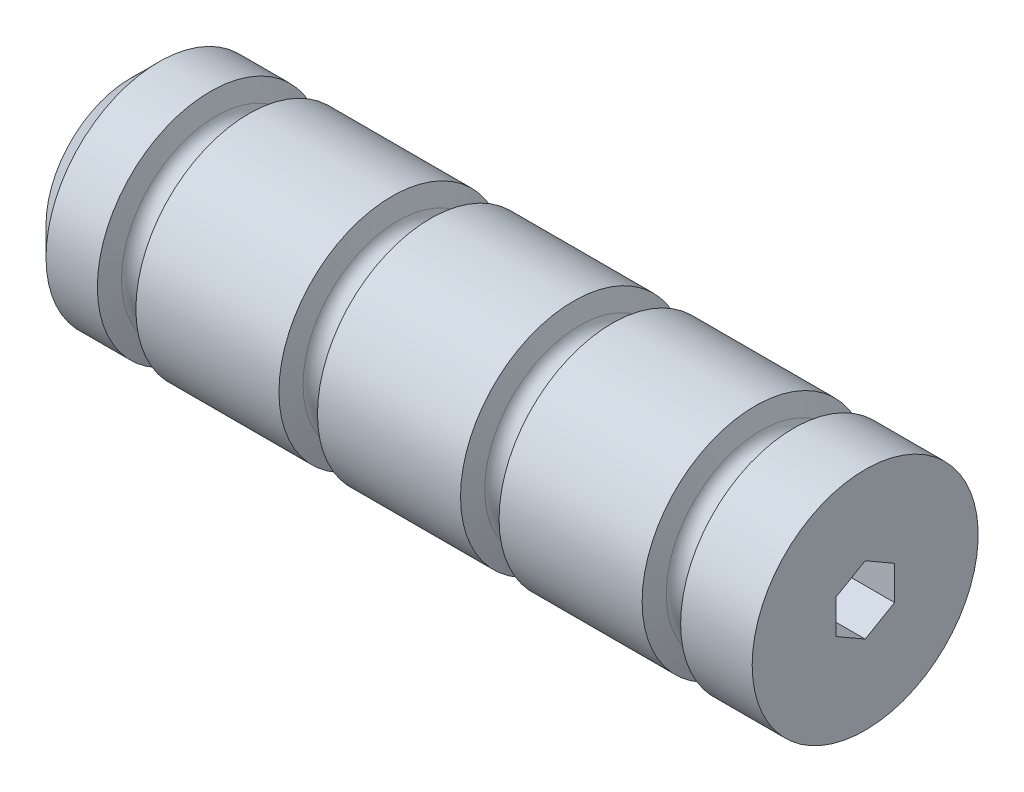
ISO-10303-21;
HEADER;
FILE_DESCRIPTION(('STEP AP214'),'2;1');
FILE_NAME('part.step','',(''),(''),'','','');
FILE_SCHEMA(('AUTOMOTIVE_DESIGN { 1 0 10303 214 1 1 1 1 }'));
ENDSEC;
DATA;
#1=APPLICATION_CONTEXT('core data for automotive mechanical design processes');
#2=APPLICATION_PROTOCOL_DEFINITION('international standard','automotive_design',2000,#1);
#3=PRODUCT_CONTEXT('',#1,'mechanical');
#4=PRODUCT('Part','Part','',(#3));
#5=PRODUCT_RELATED_PRODUCT_CATEGORY('part','',(#4));
#6=PRODUCT_DEFINITION_FORMATION('','',#4);
#7=PRODUCT_DEFINITION_CONTEXT('part definition',#1,'design');
#8=PRODUCT_DEFINITION('design','',#6,#7);
#9=PRODUCT_DEFINITION_SHAPE('','',#8);
#10=(LENGTH_UNIT() NAMED_UNIT(*) SI_UNIT(.MILLI.,.METRE.));
#11=(NAMED_UNIT(*) PLANE_ANGLE_UNIT() SI_UNIT($,.RADIAN.));
#12=(NAMED_UNIT(*) SI_UNIT($,.STERADIAN.) SOLID_ANGLE_UNIT());
#13=UNCERTAINTY_MEASURE_WITH_UNIT(LENGTH_MEASURE(1.E-05),#10,'distance_accuracy_value','');
#14=(GEOMETRIC_REPRESENTATION_CONTEXT(3) GLOBAL_UNCERTAINTY_ASSIGNED_CONTEXT((#13)) GLOBAL_UNIT_ASSIGNED_CONTEXT((#10,
#11,#12)) REPRESENTATION_CONTEXT('',''));
#15=CARTESIAN_POINT('',(0.,0.,0.));
#16=DIRECTION('',(0.,0.,1.));
#17=DIRECTION('',(1.,0.,0.));
#18=AXIS2_PLACEMENT_3D('',#15,#16,#17);
#19=CARTESIAN_POINT('',(0.,0.,0.));
#20=DIRECTION('',(-1.,0.,0.));
#21=DIRECTION('',(0.,0.,1.));
#22=AXIS2_PLACEMENT_3D('',#19,#20,#21);
#23=CYLINDRICAL_SURFACE('',#22,25.4);
#24=CARTESIAN_POINT('',(-158.75,0.,0.));
#25=DIRECTION('',(-1.,0.,0.));
#26=DIRECTION('',(0.,0.,1.));
#27=AXIS2_PLACEMENT_3D('',#24,#25,#26);
#28=CIRCLE('',#27,25.4);
#29=CARTESIAN_POINT('',(-158.75,0.,25.4));
#30=VERTEX_POINT('',#29);
#31=EDGE_CURVE('E41',#30,#30,#28,.T.);
#32=ORIENTED_EDGE('',*,*,#31,.F.);
#33=EDGE_LOOP('',(#32));
#34=FACE_BOUND('',#33,.T.);
#35=CARTESIAN_POINT('',(-147.205153627013,0.,0.));
#36=DIRECTION('',(-1.,0.,0.));
#37=DIRECTION('',(0.,0.,1.));
#38=AXIS2_PLACEMENT_3D('',#35,#36,#37);
#39=CIRCLE('',#38,25.3999999999991);
#40=CARTESIAN_POINT('',(-147.205153627013,0.,25.3999999999991));
#41=VERTEX_POINT('',#40);
#42=EDGE_CURVE('E131',#41,#41,#39,.T.);
#43=ORIENTED_EDGE('',*,*,#42,.T.);
#44=EDGE_LOOP('',(#43));
#45=FACE_BOUND('',#44,.T.);
#46=ADVANCED_FACE('F33',(#34,#45),#23,.T.);
#47=CARTESIAN_POINT('',(-158.75,0.,0.));
#48=DIRECTION('',(1.,0.,0.));
#49=DIRECTION('',(0.,0.,-1.));
#50=AXIS2_PLACEMENT_3D('',#47,#48,#49);
#51=CONICAL_SURFACE('',#50,25.4,0.785398163397449);
#52=CARTESIAN_POINT('',(-165.1,0.,0.));
#53=DIRECTION('',(-1.,0.,0.));
#54=DIRECTION('',(0.,0.,1.));
#55=AXIS2_PLACEMENT_3D('',#52,#53,#54);
#56=CIRCLE('',#55,19.05);
#57=CARTESIAN_POINT('',(-165.1,0.,19.05));
#58=VERTEX_POINT('',#57);
#59=EDGE_CURVE('E152',#58,#58,#56,.T.);
#60=ORIENTED_EDGE('',*,*,#59,.F.);
#61=EDGE_LOOP('',(#60));
#62=FACE_BOUND('',#61,.T.);
#63=ORIENTED_EDGE('',*,*,#31,.T.);
#64=EDGE_LOOP('',(#63));
#65=FACE_BOUND('',#64,.T.);
#66=ADVANCED_FACE('F191',(#62,#65),#51,.T.);
#67=CARTESIAN_POINT('',(-165.1,19.05,0.));
#68=DIRECTION('',(1.,0.,0.));
#69=DIRECTION('',(0.,0.,-1.));
#70=AXIS2_PLACEMENT_3D('',#67,#68,#69);
#71=PLANE('',#70);
#72=DIRECTION('',(0.,1.,0.));
#73=VECTOR('',#72,1.);
#74=CARTESIAN_POINT('',(-165.1,-3.81282117772829,-6.604));
#75=LINE('',#74,#73);
#76=CARTESIAN_POINT('',(-165.1,-3.81282117772829,-6.604));
#77=VERTEX_POINT('',#76);
#78=CARTESIAN_POINT('',(-165.1,3.81282117772829,-6.604));
#79=VERTEX_POINT('',#78);
#80=EDGE_CURVE('E94',#77,#79,#75,.T.);
#81=ORIENTED_EDGE('',*,*,#80,.T.);
#82=DIRECTION('',(0.,0.5,0.866025403784439));
#83=VECTOR('',#82,1.);
#84=CARTESIAN_POINT('',(-165.1,3.81282117772829,-6.604));
#85=LINE('',#84,#83);
#86=CARTESIAN_POINT('',(-165.1,7.62564235545658,0.));
#87=VERTEX_POINT('',#86);
#88=EDGE_CURVE('E88',#79,#87,#85,.T.);
#89=ORIENTED_EDGE('',*,*,#88,.T.);
#90=DIRECTION('',(0.,-0.5,0.866025403784439));
#91=VECTOR('',#90,1.);
#92=CARTESIAN_POINT('',(-165.1,7.62564235545658,0.));
#93=LINE('',#92,#91);
#94=CARTESIAN_POINT('',(-165.1,3.81282117772829,6.604));
#95=VERTEX_POINT('',#94);
#96=EDGE_CURVE('E97',#87,#95,#93,.T.);
#97=ORIENTED_EDGE('',*,*,#96,.T.);
#98=DIRECTION('',(0.,-1.,0.));
#99=VECTOR('',#98,1.);
#100=CARTESIAN_POINT('',(-165.1,3.81282117772829,6.604));
#101=LINE('',#100,#99);
#102=CARTESIAN_POINT('',(-165.1,-3.81282117772829,6.604));
#103=VERTEX_POINT('',#102);
#104=EDGE_CURVE('E48',#95,#103,#101,.T.);
#105=ORIENTED_EDGE('',*,*,#104,.T.);
#106=DIRECTION('',(0.,-0.5,-0.866025403784438));
#107=VECTOR('',#106,1.);
#108=CARTESIAN_POINT('',(-165.1,-3.81282117772829,6.604));
#109=LINE('',#108,#107);
#110=CARTESIAN_POINT('',(-165.1,-7.62564235545658,0.));
#111=VERTEX_POINT('',#110);
#112=EDGE_CURVE('E112',#103,#111,#109,.T.);
#113=ORIENTED_EDGE('',*,*,#112,.T.);
#114=DIRECTION('',(0.,0.5,-0.866025403784439));
#115=VECTOR('',#114,1.);
#116=CARTESIAN_POINT('',(-165.1,-7.62564235545658,0.));
#117=LINE('',#116,#115);
#118=EDGE_CURVE('E115',#111,#77,#117,.T.);
#119=ORIENTED_EDGE('',*,*,#118,.T.);
#120=EDGE_LOOP('',(#81,#89,#97,#105,#113,#119));
#121=FACE_BOUND('',#120,.T.);
#122=ORIENTED_EDGE('',*,*,#59,.T.);
#123=EDGE_LOOP('',(#122));
#124=FACE_BOUND('',#123,.T.);
#125=ADVANCED_FACE('F101',(#121,#124),#71,.F.);
#126=CARTESIAN_POINT('',(-139.846948681374,0.,0.));
#127=DIRECTION('',(1.,0.,0.));
#128=DIRECTION('',(0.,0.,-1.));
#129=AXIS2_PLACEMENT_3D('',#126,#127,#128);
#130=CONICAL_SURFACE('',#129,21.2702590865731,1.26536370769589);
#131=CARTESIAN_POINT('',(-138.544846372987,0.,0.));
#132=DIRECTION('',(-1.,0.,0.));
#133=DIRECTION('',(0.,0.,1.));
#134=AXIS2_PLACEMENT_3D('',#131,#132,#133);
#135=CIRCLE('',#134,25.3999999999991);
#136=CARTESIAN_POINT('',(-138.544846372987,0.,25.3999999999991));
#137=VERTEX_POINT('',#136);
#138=EDGE_CURVE('E169',#137,#137,#135,.T.);
#139=ORIENTED_EDGE('',*,*,#138,.T.);
#140=EDGE_LOOP('',(#139));
#141=FACE_BOUND('',#140,.T.);
#142=CARTESIAN_POINT('',(-139.846948681374,0.,0.));
#143=DIRECTION('',(-1.,0.,0.));
#144=DIRECTION('',(0.,0.,1.));
#145=AXIS2_PLACEMENT_3D('',#142,#143,#144);
#146=CIRCLE('',#145,21.2702590865731);
#147=CARTESIAN_POINT('',(-139.846948681374,0.,21.2702590865731));
#148=VERTEX_POINT('',#147);
#149=EDGE_CURVE('E182',#148,#148,#146,.T.);
#150=ORIENTED_EDGE('',*,*,#149,.F.);
#151=EDGE_LOOP('',(#150));
#152=FACE_BOUND('',#151,.T.);
#153=ADVANCED_FACE('F211',(#141,#152),#130,.T.);
#154=CARTESIAN_POINT('',(-142.875,0.,0.));
#155=DIRECTION('',(-1.,0.,0.));
#156=DIRECTION('',(0.,0.,1.));
#157=AXIS2_PLACEMENT_3D('',#154,#155,#156);
#158=TOROIDAL_SURFACE('',#157,22.2249999999991,3.17499999999999);
#159=ORIENTED_EDGE('',*,*,#149,.T.);
#160=EDGE_LOOP('',(#159));
#161=FACE_BOUND('',#160,.T.);
#162=CARTESIAN_POINT('',(-145.903051318626,0.,0.));
#163=DIRECTION('',(-1.,0.,0.));
#164=DIRECTION('',(0.,0.,1.));
#165=AXIS2_PLACEMENT_3D('',#162,#163,#164);
#166=CIRCLE('',#165,21.2702590865731);
#167=CARTESIAN_POINT('',(-145.903051318626,0.,21.2702590865731));
#168=VERTEX_POINT('',#167);
#169=EDGE_CURVE('E179',#168,#168,#166,.T.);
#170=ORIENTED_EDGE('',*,*,#169,.F.);
#171=EDGE_LOOP('',(#170));
#172=FACE_BOUND('',#171,.T.);
#173=ADVANCED_FACE('F201',(#161,#172),#158,.F.);
#174=CARTESIAN_POINT('',(-147.205153627013,0.,0.));
#175=DIRECTION('',(-1.,0.,0.));
#176=DIRECTION('',(0.,0.,1.));
#177=AXIS2_PLACEMENT_3D('',#174,#175,#176);
#178=CONICAL_SURFACE('',#177,25.3999999999991,1.26536370769589);
#179=ORIENTED_EDGE('',*,*,#169,.T.);
#180=EDGE_LOOP('',(#179));
#181=FACE_BOUND('',#180,.T.);
#182=ORIENTED_EDGE('',*,*,#42,.F.);
#183=EDGE_LOOP('',(#182));
#184=FACE_BOUND('',#183,.T.);
#185=ADVANCED_FACE('F199',(#181,#184),#178,.T.);
#186=ORIENTED_EDGE('',*,*,#138,.F.);
#187=EDGE_LOOP('',(#186));
#188=FACE_BOUND('',#187,.T.);
#189=CARTESIAN_POINT('',(-106.383725055584,0.,0.));
#190=DIRECTION('',(-1.,0.,0.));
#191=DIRECTION('',(0.,0.,1.));
#192=AXIS2_PLACEMENT_3D('',#189,#190,#191);
#193=CIRCLE('',#192,25.3999999999994);
#194=CARTESIAN_POINT('',(-106.383725055584,0.,25.3999999999994));
#195=VERTEX_POINT('',#194);
#196=EDGE_CURVE('E165',#195,#195,#193,.T.);
#197=ORIENTED_EDGE('',*,*,#196,.T.);
#198=EDGE_LOOP('',(#197));
#199=FACE_BOUND('',#198,.T.);
#200=ADVANCED_FACE('F196',(#188,#199),#23,.T.);
#201=CARTESIAN_POINT('',(-99.0255201099458,0.,0.));
#202=DIRECTION('',(1.,0.,0.));
#203=DIRECTION('',(0.,0.,-1.));
#204=AXIS2_PLACEMENT_3D('',#201,#202,#203);
#205=CONICAL_SURFACE('',#204,21.2702590865734,1.26536370769589);
#206=CARTESIAN_POINT('',(-97.7234178015586,0.,0.));
#207=DIRECTION('',(-1.,0.,0.));
#208=DIRECTION('',(0.,0.,1.));
#209=AXIS2_PLACEMENT_3D('',#206,#207,#208);
#210=CIRCLE('',#209,25.3999999999994);
#211=CARTESIAN_POINT('',(-97.7234178015586,0.,25.3999999999994));
#212=VERTEX_POINT('',#211);
#213=EDGE_CURVE('E157',#212,#212,#210,.T.);
#214=ORIENTED_EDGE('',*,*,#213,.T.);
#215=EDGE_LOOP('',(#214));
#216=FACE_BOUND('',#215,.T.);
#217=CARTESIAN_POINT('',(-99.0255201099458,0.,0.));
#218=DIRECTION('',(-1.,0.,0.));
#219=DIRECTION('',(0.,0.,1.));
#220=AXIS2_PLACEMENT_3D('',#217,#218,#219);
#221=CIRCLE('',#220,21.2702590865734);
#222=CARTESIAN_POINT('',(-99.0255201099458,0.,21.2702590865734));
#223=VERTEX_POINT('',#222);
#224=EDGE_CURVE('E172',#223,#223,#221,.T.);
#225=ORIENTED_EDGE('',*,*,#224,.F.);
#226=EDGE_LOOP('',(#225));
#227=FACE_BOUND('',#226,.T.);
#228=ADVANCED_FACE('F208',(#216,#227),#205,.T.);
#229=CARTESIAN_POINT('',(-102.053571428571,0.,0.));
#230=DIRECTION('',(-1.,0.,0.));
#231=DIRECTION('',(0.,0.,1.));
#232=AXIS2_PLACEMENT_3D('',#229,#230,#231);
#233=TOROIDAL_SURFACE('',#232,22.2249999999994,3.17499999999999);
#234=ORIENTED_EDGE('',*,*,#224,.T.);
#235=EDGE_LOOP('',(#234));
#236=FACE_BOUND('',#235,.T.);
#237=CARTESIAN_POINT('',(-105.081622747197,0.,0.));
#238=DIRECTION('',(-1.,0.,0.));
#239=DIRECTION('',(0.,0.,1.));
#240=AXIS2_PLACEMENT_3D('',#237,#238,#239);
#241=CIRCLE('',#240,21.2702590865734);
#242=CARTESIAN_POINT('',(-105.081622747197,0.,21.2702590865734));
#243=VERTEX_POINT('',#242);
#244=EDGE_CURVE('E168',#243,#243,#241,.T.);
#245=ORIENTED_EDGE('',*,*,#244,.F.);
#246=EDGE_LOOP('',(#245));
#247=FACE_BOUND('',#246,.T.);
#248=ADVANCED_FACE('F262',(#236,#247),#233,.F.);
#249=CARTESIAN_POINT('',(-106.383725055584,0.,0.));
#250=DIRECTION('',(-1.,0.,0.));
#251=DIRECTION('',(0.,0.,1.));
#252=AXIS2_PLACEMENT_3D('',#249,#250,#251);
#253=CONICAL_SURFACE('',#252,25.3999999999994,1.26536370769589);
#254=ORIENTED_EDGE('',*,*,#244,.T.);
#255=EDGE_LOOP('',(#254));
#256=FACE_BOUND('',#255,.T.);
#257=ORIENTED_EDGE('',*,*,#196,.F.);
#258=EDGE_LOOP('',(#257));
#259=FACE_BOUND('',#258,.T.);
#260=ADVANCED_FACE('F254',(#256,#259),#253,.T.);
#261=ORIENTED_EDGE('',*,*,#213,.F.);
#262=EDGE_LOOP('',(#261));
#263=FACE_BOUND('',#262,.T.);
#264=CARTESIAN_POINT('',(-65.5622964841557,0.,0.));
#265=DIRECTION('',(-1.,0.,0.));
#266=DIRECTION('',(0.,0.,1.));
#267=AXIS2_PLACEMENT_3D('',#264,#265,#266);
#268=CIRCLE('',#267,25.3999999999997);
#269=CARTESIAN_POINT('',(-65.5622964841557,0.,25.3999999999997));
#270=VERTEX_POINT('',#269);
#271=EDGE_CURVE('E153',#270,#270,#268,.T.);
#272=ORIENTED_EDGE('',*,*,#271,.T.);
#273=EDGE_LOOP('',(#272));
#274=FACE_BOUND('',#273,.T.);
#275=ADVANCED_FACE('F210',(#263,#274),#23,.T.);
#276=CARTESIAN_POINT('',(-58.2040915385172,0.,0.));
#277=DIRECTION('',(1.,0.,0.));
#278=DIRECTION('',(0.,0.,-1.));
#279=AXIS2_PLACEMENT_3D('',#276,#277,#278);
#280=CONICAL_SURFACE('',#279,21.2702590865737,1.26536370769589);
#281=CARTESIAN_POINT('',(-56.90198923013,0.,0.));
#282=DIRECTION('',(-1.,0.,0.));
#283=DIRECTION('',(0.,0.,1.));
#284=AXIS2_PLACEMENT_3D('',#281,#282,#283);
#285=CIRCLE('',#284,25.3999999999997);
#286=CARTESIAN_POINT('',(-56.90198923013,0.,25.3999999999997));
#287=VERTEX_POINT('',#286);
#288=EDGE_CURVE('E143',#287,#287,#285,.T.);
#289=ORIENTED_EDGE('',*,*,#288,.T.);
#290=EDGE_LOOP('',(#289));
#291=FACE_BOUND('',#290,.T.);
#292=CARTESIAN_POINT('',(-58.2040915385172,0.,0.));
#293=DIRECTION('',(-1.,0.,0.));
#294=DIRECTION('',(0.,0.,1.));
#295=AXIS2_PLACEMENT_3D('',#292,#293,#294);
#296=CIRCLE('',#295,21.2702590865737);
#297=CARTESIAN_POINT('',(-58.2040915385172,0.,21.2702590865737));
#298=VERTEX_POINT('',#297);
#299=EDGE_CURVE('E160',#298,#298,#296,.T.);
#300=ORIENTED_EDGE('',*,*,#299,.F.);
#301=EDGE_LOOP('',(#300));
#302=FACE_BOUND('',#301,.T.);
#303=ADVANCED_FACE('F253',(#291,#302),#280,.T.);
#304=CARTESIAN_POINT('',(-61.2321428571429,0.,0.));
#305=DIRECTION('',(-1.,0.,0.));
#306=DIRECTION('',(0.,0.,1.));
#307=AXIS2_PLACEMENT_3D('',#304,#305,#306);
#308=TOROIDAL_SURFACE('',#307,22.2249999999997,3.17499999999999);
#309=ORIENTED_EDGE('',*,*,#299,.T.);
#310=EDGE_LOOP('',(#309));
#311=FACE_BOUND('',#310,.T.);
#312=CARTESIAN_POINT('',(-64.2601941757685,0.,0.));
#313=DIRECTION('',(-1.,0.,0.));
#314=DIRECTION('',(0.,0.,1.));
#315=AXIS2_PLACEMENT_3D('',#312,#313,#314);
#316=CIRCLE('',#315,21.2702590865737);
#317=CARTESIAN_POINT('',(-64.2601941757685,0.,21.2702590865737));
#318=VERTEX_POINT('',#317);
#319=EDGE_CURVE('E156',#318,#318,#316,.T.);
#320=ORIENTED_EDGE('',*,*,#319,.F.);
#321=EDGE_LOOP('',(#320));
#322=FACE_BOUND('',#321,.T.);
#323=ADVANCED_FACE('F247',(#311,#322),#308,.F.);
#324=CARTESIAN_POINT('',(-65.5622964841557,0.,0.));
#325=DIRECTION('',(-1.,0.,0.));
#326=DIRECTION('',(0.,0.,1.));
#327=AXIS2_PLACEMENT_3D('',#324,#325,#326);
#328=CONICAL_SURFACE('',#327,25.3999999999997,1.26536370769589);
#329=ORIENTED_EDGE('',*,*,#319,.T.);
#330=EDGE_LOOP('',(#329));
#331=FACE_BOUND('',#330,.T.);
#332=ORIENTED_EDGE('',*,*,#271,.F.);
#333=EDGE_LOOP('',(#332));
#334=FACE_BOUND('',#333,.T.);
#335=ADVANCED_FACE('F238',(#331,#334),#328,.T.);
#336=ORIENTED_EDGE('',*,*,#288,.F.);
#337=EDGE_LOOP('',(#336));
#338=FACE_BOUND('',#337,.T.);
#339=CARTESIAN_POINT('',(-24.7408679127271,0.,0.));
#340=DIRECTION('',(-1.,0.,0.));
#341=DIRECTION('',(0.,0.,1.));
#342=AXIS2_PLACEMENT_3D('',#339,#340,#341);
#343=CIRCLE('',#342,25.4);
#344=CARTESIAN_POINT('',(-24.7408679127271,0.,25.4));
#345=VERTEX_POINT('',#344);
#346=EDGE_CURVE('E139',#345,#345,#343,.T.);
#347=ORIENTED_EDGE('',*,*,#346,.T.);
#348=EDGE_LOOP('',(#347));
#349=FACE_BOUND('',#348,.T.);
#350=ADVANCED_FACE('F226',(#338,#349),#23,.T.);
#351=CARTESIAN_POINT('',(-17.3826629670887,0.,0.));
#352=DIRECTION('',(1.,0.,0.));
#353=DIRECTION('',(0.,0.,-1.));
#354=AXIS2_PLACEMENT_3D('',#351,#352,#353);
#355=CONICAL_SURFACE('',#354,21.2702590865739,1.26536370769589);
#356=CARTESIAN_POINT('',(-16.0805606587014,0.,0.));
#357=DIRECTION('',(-1.,0.,0.));
#358=DIRECTION('',(0.,0.,1.));
#359=AXIS2_PLACEMENT_3D('',#356,#357,#358);
#360=CIRCLE('',#359,25.4);
#361=CARTESIAN_POINT('',(-16.0805606587014,0.,25.4));
#362=VERTEX_POINT('',#361);
#363=EDGE_CURVE('E149',#362,#362,#360,.T.);
#364=ORIENTED_EDGE('',*,*,#363,.T.);
#365=EDGE_LOOP('',(#364));
#366=FACE_BOUND('',#365,.T.);
#367=CARTESIAN_POINT('',(-17.3826629670887,0.,0.));
#368=DIRECTION('',(-1.,0.,0.));
#369=DIRECTION('',(0.,0.,1.));
#370=AXIS2_PLACEMENT_3D('',#367,#368,#369);
#371=CIRCLE('',#370,21.2702590865739);
#372=CARTESIAN_POINT('',(-17.3826629670887,0.,21.2702590865739));
#373=VERTEX_POINT('',#372);
#374=EDGE_CURVE('E146',#373,#373,#371,.T.);
#375=ORIENTED_EDGE('',*,*,#374,.F.);
#376=EDGE_LOOP('',(#375));
#377=FACE_BOUND('',#376,.T.);
#378=ADVANCED_FACE('F237',(#366,#377),#355,.T.);
#379=CARTESIAN_POINT('',(-20.4107142857143,0.,0.));
#380=DIRECTION('',(-1.,0.,0.));
#381=DIRECTION('',(0.,0.,1.));
#382=AXIS2_PLACEMENT_3D('',#379,#380,#381);
#383=TOROIDAL_SURFACE('',#382,22.225,3.175);
#384=ORIENTED_EDGE('',*,*,#374,.T.);
#385=EDGE_LOOP('',(#384));
#386=FACE_BOUND('',#385,.T.);
#387=CARTESIAN_POINT('',(-23.4387656043399,0.,0.));
#388=DIRECTION('',(-1.,0.,0.));
#389=DIRECTION('',(0.,0.,1.));
#390=AXIS2_PLACEMENT_3D('',#387,#388,#389);
#391=CIRCLE('',#390,21.2702590865739);
#392=CARTESIAN_POINT('',(-23.4387656043399,0.,21.2702590865739));
#393=VERTEX_POINT('',#392);
#394=EDGE_CURVE('E142',#393,#393,#391,.T.);
#395=ORIENTED_EDGE('',*,*,#394,.F.);
#396=EDGE_LOOP('',(#395));
#397=FACE_BOUND('',#396,.T.);
#398=ADVANCED_FACE('F244',(#386,#397),#383,.F.);
#399=CARTESIAN_POINT('',(-24.7408679127271,0.,0.));
#400=DIRECTION('',(-1.,0.,0.));
#401=DIRECTION('',(0.,0.,1.));
#402=AXIS2_PLACEMENT_3D('',#399,#400,#401);
#403=CONICAL_SURFACE('',#402,25.4,1.26536370769589);
#404=ORIENTED_EDGE('',*,*,#394,.T.);
#405=EDGE_LOOP('',(#404));
#406=FACE_BOUND('',#405,.T.);
#407=ORIENTED_EDGE('',*,*,#346,.F.);
#408=EDGE_LOOP('',(#407));
#409=FACE_BOUND('',#408,.T.);
#410=ADVANCED_FACE('F233',(#406,#409),#403,.T.);
#411=CARTESIAN_POINT('',(0.,0.,0.));
#412=DIRECTION('',(-1.,0.,0.));
#413=DIRECTION('',(0.,0.,1.));
#414=AXIS2_PLACEMENT_3D('',#411,#412,#413);
#415=PLANE('',#414);
#416=DIRECTION('',(0.,-0.5,0.866025403784439));
#417=VECTOR('',#416,1.);
#418=CARTESIAN_POINT('',(0.,7.62564235545658,0.));
#419=LINE('',#418,#417);
#420=CARTESIAN_POINT('',(0.,7.62564235545658,0.));
#421=VERTEX_POINT('',#420);
#422=CARTESIAN_POINT('',(0.,3.81282117772829,6.604));
#423=VERTEX_POINT('',#422);
#424=EDGE_CURVE('E119',#421,#423,#419,.T.);
#425=ORIENTED_EDGE('',*,*,#424,.F.);
#426=DIRECTION('',(0.,0.5,0.866025403784439));
#427=VECTOR('',#426,1.);
#428=CARTESIAN_POINT('',(0.,3.81282117772829,-6.604));
#429=LINE('',#428,#427);
#430=CARTESIAN_POINT('',(0.,3.81282117772829,-6.604));
#431=VERTEX_POINT('',#430);
#432=EDGE_CURVE('E56',#431,#421,#429,.T.);
#433=ORIENTED_EDGE('',*,*,#432,.F.);
#434=DIRECTION('',(0.,1.,0.));
#435=VECTOR('',#434,1.);
#436=CARTESIAN_POINT('',(0.,-3.81282117772829,-6.604));
#437=LINE('',#436,#435);
#438=CARTESIAN_POINT('',(0.,-3.81282117772829,-6.604));
#439=VERTEX_POINT('',#438);
#440=EDGE_CURVE('E105',#439,#431,#437,.T.);
#441=ORIENTED_EDGE('',*,*,#440,.F.);
#442=DIRECTION('',(0.,0.5,-0.866025403784439));
#443=VECTOR('',#442,1.);
#444=CARTESIAN_POINT('',(0.,-7.62564235545658,0.));
#445=LINE('',#444,#443);
#446=CARTESIAN_POINT('',(0.,-7.62564235545658,0.));
#447=VERTEX_POINT('',#446);
#448=EDGE_CURVE('E108',#447,#439,#445,.T.);
#449=ORIENTED_EDGE('',*,*,#448,.F.);
#450=DIRECTION('',(0.,-0.5,-0.866025403784438));
#451=VECTOR('',#450,1.);
#452=CARTESIAN_POINT('',(0.,-3.81282117772829,6.604));
#453=LINE('',#452,#451);
#454=CARTESIAN_POINT('',(0.,-3.81282117772829,6.604));
#455=VERTEX_POINT('',#454);
#456=EDGE_CURVE('E124',#455,#447,#453,.T.);
#457=ORIENTED_EDGE('',*,*,#456,.F.);
#458=DIRECTION('',(0.,-1.,0.));
#459=VECTOR('',#458,1.);
#460=CARTESIAN_POINT('',(0.,3.81282117772829,6.604));
#461=LINE('',#460,#459);
#462=EDGE_CURVE('E121',#423,#455,#461,.T.);
#463=ORIENTED_EDGE('',*,*,#462,.F.);
#464=EDGE_LOOP('',(#425,#433,#441,#449,#457,#463));
#465=FACE_BOUND('',#464,.T.);
#466=CARTESIAN_POINT('',(0.,0.,0.));
#467=DIRECTION('',(-1.,0.,0.));
#468=DIRECTION('',(0.,0.,1.));
#469=AXIS2_PLACEMENT_3D('',#466,#467,#468);
#470=CIRCLE('',#469,25.4);
#471=CARTESIAN_POINT('',(0.,0.,25.4));
#472=VERTEX_POINT('',#471);
#473=EDGE_CURVE('E12',#472,#472,#470,.T.);
#474=ORIENTED_EDGE('',*,*,#473,.F.);
#475=EDGE_LOOP('',(#474));
#476=FACE_BOUND('',#475,.T.);
#477=ADVANCED_FACE('F35',(#465,#476),#415,.F.);
#478=ORIENTED_EDGE('',*,*,#473,.T.);
#479=EDGE_LOOP('',(#478));
#480=FACE_BOUND('',#479,.T.);
#481=ORIENTED_EDGE('',*,*,#363,.F.);
#482=EDGE_LOOP('',(#481));
#483=FACE_BOUND('',#482,.T.);
#484=ADVANCED_FACE('F195',(#480,#483),#23,.T.);
#485=CARTESIAN_POINT('',(-165.1,3.81282117772829,-6.604));
#486=DIRECTION('',(0.,0.866025403784439,-0.5));
#487=DIRECTION('',(0.,0.5,0.866025403784439));
#488=AXIS2_PLACEMENT_3D('',#485,#486,#487);
#489=PLANE('',#488);
#490=ORIENTED_EDGE('',*,*,#432,.T.);
#491=DIRECTION('',(1.,0.,0.));
#492=VECTOR('',#491,1.);
#493=CARTESIAN_POINT('',(-165.1,7.62564235545658,0.));
#494=LINE('',#493,#492);
#495=EDGE_CURVE('E84',#87,#421,#494,.T.);
#496=ORIENTED_EDGE('',*,*,#495,.F.);
#497=ORIENTED_EDGE('',*,*,#88,.F.);
#498=DIRECTION('',(1.,0.,0.));
#499=VECTOR('',#498,1.);
#500=CARTESIAN_POINT('',(-165.1,3.81282117772829,-6.604));
#501=LINE('',#500,#499);
#502=EDGE_CURVE('E129',#79,#431,#501,.T.);
#503=ORIENTED_EDGE('',*,*,#502,.T.);
#504=EDGE_LOOP('',(#490,#496,#497,#503));
#505=FACE_BOUND('',#504,.T.);
#506=ADVANCED_FACE('F86',(#505),#489,.F.);
#507=CARTESIAN_POINT('',(-165.1,-3.81282117772829,-6.604));
#508=DIRECTION('',(0.,0.,-1.));
#509=DIRECTION('',(-1.,0.,0.));
#510=AXIS2_PLACEMENT_3D('',#507,#508,#509);
#511=PLANE('',#510);
#512=ORIENTED_EDGE('',*,*,#440,.T.);
#513=ORIENTED_EDGE('',*,*,#502,.F.);
#514=ORIENTED_EDGE('',*,*,#80,.F.);
#515=DIRECTION('',(1.,0.,0.));
#516=VECTOR('',#515,1.);
#517=CARTESIAN_POINT('',(-165.1,-3.81282117772829,-6.604));
#518=LINE('',#517,#516);
#519=EDGE_CURVE('E132',#77,#439,#518,.T.);
#520=ORIENTED_EDGE('',*,*,#519,.T.);
#521=EDGE_LOOP('',(#512,#513,#514,#520));
#522=FACE_BOUND('',#521,.T.);
#523=ADVANCED_FACE('F231',(#522),#511,.F.);
#524=CARTESIAN_POINT('',(-165.1,-7.62564235545658,0.));
#525=DIRECTION('',(0.,-0.866025403784439,-0.5));
#526=DIRECTION('',(0.,0.5,-0.866025403784439));
#527=AXIS2_PLACEMENT_3D('',#524,#525,#526);
#528=PLANE('',#527);
#529=ORIENTED_EDGE('',*,*,#448,.T.);
#530=ORIENTED_EDGE('',*,*,#519,.F.);
#531=ORIENTED_EDGE('',*,*,#118,.F.);
#532=DIRECTION('',(1.,0.,0.));
#533=VECTOR('',#532,1.);
#534=CARTESIAN_POINT('',(-165.1,-7.62564235545658,0.));
#535=LINE('',#534,#533);
#536=EDGE_CURVE('E134',#111,#447,#535,.T.);
#537=ORIENTED_EDGE('',*,*,#536,.T.);
#538=EDGE_LOOP('',(#529,#530,#531,#537));
#539=FACE_BOUND('',#538,.T.);
#540=ADVANCED_FACE('F300',(#539),#528,.F.);
#541=CARTESIAN_POINT('',(-165.1,-3.81282117772829,6.604));
#542=DIRECTION('',(0.,-0.866025403784438,0.5));
#543=DIRECTION('',(0.,-0.5,-0.866025403784438));
#544=AXIS2_PLACEMENT_3D('',#541,#542,#543);
#545=PLANE('',#544);
#546=ORIENTED_EDGE('',*,*,#456,.T.);
#547=ORIENTED_EDGE('',*,*,#536,.F.);
#548=ORIENTED_EDGE('',*,*,#112,.F.);
#549=DIRECTION('',(1.,0.,0.));
#550=VECTOR('',#549,1.);
#551=CARTESIAN_POINT('',(-165.1,-3.81282117772829,6.604));
#552=LINE('',#551,#550);
#553=EDGE_CURVE('E136',#103,#455,#552,.T.);
#554=ORIENTED_EDGE('',*,*,#553,.T.);
#555=EDGE_LOOP('',(#546,#547,#548,#554));
#556=FACE_BOUND('',#555,.T.);
#557=ADVANCED_FACE('F297',(#556),#545,.F.);
#558=CARTESIAN_POINT('',(-165.1,3.81282117772829,6.604));
#559=DIRECTION('',(0.,0.,1.));
#560=DIRECTION('',(1.,0.,0.));
#561=AXIS2_PLACEMENT_3D('',#558,#559,#560);
#562=PLANE('',#561);
#563=ORIENTED_EDGE('',*,*,#462,.T.);
#564=ORIENTED_EDGE('',*,*,#553,.F.);
#565=ORIENTED_EDGE('',*,*,#104,.F.);
#566=DIRECTION('',(1.,0.,0.));
#567=VECTOR('',#566,1.);
#568=CARTESIAN_POINT('',(-165.1,3.81282117772829,6.604));
#569=LINE('',#568,#567);
#570=EDGE_CURVE('E93',#95,#423,#569,.T.);
#571=ORIENTED_EDGE('',*,*,#570,.T.);
#572=EDGE_LOOP('',(#563,#564,#565,#571));
#573=FACE_BOUND('',#572,.T.);
#574=ADVANCED_FACE('F294',(#573),#562,.F.);
#575=CARTESIAN_POINT('',(-165.1,7.62564235545658,0.));
#576=DIRECTION('',(0.,0.866025403784439,0.5));
#577=DIRECTION('',(0.,-0.5,0.866025403784439));
#578=AXIS2_PLACEMENT_3D('',#575,#576,#577);
#579=PLANE('',#578);
#580=ORIENTED_EDGE('',*,*,#424,.T.);
#581=ORIENTED_EDGE('',*,*,#570,.F.);
#582=ORIENTED_EDGE('',*,*,#96,.F.);
#583=ORIENTED_EDGE('',*,*,#495,.T.);
#584=EDGE_LOOP('',(#580,#581,#582,#583));
#585=FACE_BOUND('',#584,.T.);
#586=ADVANCED_FACE('F98',(#585),#579,.F.);
#587=CLOSED_SHELL('',(#46,#66,#125,#153,#173,#185,#200,#228,#248,#260,#275,#303,#323,#335,#350,
#378,#398,#410,#477,#484,#506,#523,#540,#557,#574,#586));
#588=MANIFOLD_SOLID_BREP('B2',#587);
#589=ADVANCED_BREP_SHAPE_REPRESENTATION('',(#18,#588),#14);
#590=SHAPE_DEFINITION_REPRESENTATION(#9,#589);
ENDSEC;
END-ISO-10303-21;
